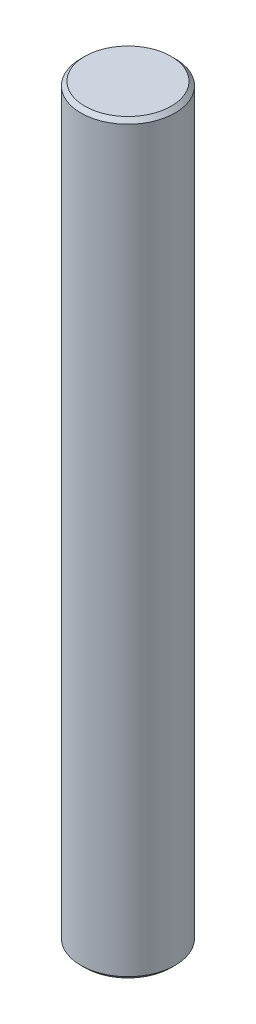
ISO-10303-21;
HEADER;
FILE_DESCRIPTION(('STEP AP214'),'2;1');
FILE_NAME('part.step','',(''),(''),'','','');
FILE_SCHEMA(('AUTOMOTIVE_DESIGN { 1 0 10303 214 1 1 1 1 }'));
ENDSEC;
DATA;
#1=APPLICATION_CONTEXT('core data for automotive mechanical design processes');
#2=APPLICATION_PROTOCOL_DEFINITION('international standard','automotive_design',2000,#1);
#3=PRODUCT_CONTEXT('',#1,'mechanical');
#4=PRODUCT('Part','Part','',(#3));
#5=PRODUCT_RELATED_PRODUCT_CATEGORY('part','',(#4));
#6=PRODUCT_DEFINITION_FORMATION('','',#4);
#7=PRODUCT_DEFINITION_CONTEXT('part definition',#1,'design');
#8=PRODUCT_DEFINITION('design','',#6,#7);
#9=PRODUCT_DEFINITION_SHAPE('','',#8);
#10=(LENGTH_UNIT() NAMED_UNIT(*) SI_UNIT(.MILLI.,.METRE.));
#11=(NAMED_UNIT(*) PLANE_ANGLE_UNIT() SI_UNIT($,.RADIAN.));
#12=(NAMED_UNIT(*) SI_UNIT($,.STERADIAN.) SOLID_ANGLE_UNIT());
#13=UNCERTAINTY_MEASURE_WITH_UNIT(LENGTH_MEASURE(1.E-05),#10,'distance_accuracy_value','');
#14=(GEOMETRIC_REPRESENTATION_CONTEXT(3) GLOBAL_UNCERTAINTY_ASSIGNED_CONTEXT((#13)) GLOBAL_UNIT_ASSIGNED_CONTEXT((#10,
#11,#12)) REPRESENTATION_CONTEXT('',''));
#15=CARTESIAN_POINT('',(0.,0.,0.));
#16=DIRECTION('',(0.,0.,1.));
#17=DIRECTION('',(1.,0.,0.));
#18=AXIS2_PLACEMENT_3D('',#15,#16,#17);
#19=CARTESIAN_POINT('',(0.,95.,0.));
#20=DIRECTION('',(0.,-1.,0.));
#21=DIRECTION('',(0.,0.,-1.));
#22=AXIS2_PLACEMENT_3D('',#19,#20,#21);
#23=CYLINDRICAL_SURFACE('',#22,6.);
#24=CARTESIAN_POINT('',(0.,0.499999999999973,0.));
#25=DIRECTION('',(0.,1.,0.));
#26=DIRECTION('',(0.,0.,1.));
#27=AXIS2_PLACEMENT_3D('',#24,#25,#26);
#28=CIRCLE('',#27,6.);
#29=CARTESIAN_POINT('',(0.,0.499999999999973,6.));
#30=VERTEX_POINT('',#29);
#31=EDGE_CURVE('E49',#30,#30,#28,.T.);
#32=ORIENTED_EDGE('',*,*,#31,.T.);
#33=EDGE_LOOP('',(#32));
#34=FACE_BOUND('',#33,.T.);
#35=CARTESIAN_POINT('',(0.,94.5,0.));
#36=DIRECTION('',(0.,1.,0.));
#37=DIRECTION('',(0.,0.,1.));
#38=AXIS2_PLACEMENT_3D('',#35,#36,#37);
#39=CIRCLE('',#38,6.);
#40=CARTESIAN_POINT('',(0.,94.5,6.));
#41=VERTEX_POINT('',#40);
#42=EDGE_CURVE('E53',#41,#41,#39,.F.);
#43=ORIENTED_EDGE('',*,*,#42,.T.);
#44=EDGE_LOOP('',(#43));
#45=FACE_BOUND('',#44,.T.);
#46=ADVANCED_FACE('F37',(#34,#45),#23,.T.);
#47=CARTESIAN_POINT('',(0.,95.,0.));
#48=DIRECTION('',(0.,1.,0.));
#49=DIRECTION('',(0.,0.,1.));
#50=AXIS2_PLACEMENT_3D('',#47,#48,#49);
#51=PLANE('',#50);
#52=CARTESIAN_POINT('',(0.,95.,0.));
#53=DIRECTION('',(0.,1.,0.));
#54=DIRECTION('',(0.,0.,1.));
#55=AXIS2_PLACEMENT_3D('',#52,#53,#54);
#56=CIRCLE('',#55,5.50000000000001);
#57=CARTESIAN_POINT('',(0.,95.,5.50000000000001));
#58=VERTEX_POINT('',#57);
#59=EDGE_CURVE('E10',#58,#58,#56,.T.);
#60=ORIENTED_EDGE('',*,*,#59,.T.);
#61=EDGE_LOOP('',(#60));
#62=FACE_BOUND('',#61,.T.);
#63=ADVANCED_FACE('F69',(#62),#51,.T.);
#64=CARTESIAN_POINT('',(0.,0.,0.));
#65=DIRECTION('',(0.,1.,0.));
#66=DIRECTION('',(0.,0.,1.));
#67=AXIS2_PLACEMENT_3D('',#64,#65,#66);
#68=PLANE('',#67);
#69=CARTESIAN_POINT('',(0.,0.,0.));
#70=DIRECTION('',(0.,1.,0.));
#71=DIRECTION('',(0.,0.,1.));
#72=AXIS2_PLACEMENT_3D('',#69,#70,#71);
#73=CIRCLE('',#72,5.50000000000002);
#74=CARTESIAN_POINT('',(0.,0.,5.50000000000002));
#75=VERTEX_POINT('',#74);
#76=EDGE_CURVE('E45',#75,#75,#73,.F.);
#77=ORIENTED_EDGE('',*,*,#76,.T.);
#78=EDGE_LOOP('',(#77));
#79=FACE_BOUND('',#78,.T.);
#80=ADVANCED_FACE('F66',(#79),#68,.F.);
#81=CARTESIAN_POINT('',(0.,0.499999999999973,0.));
#82=DIRECTION('',(0.,1.,0.));
#83=DIRECTION('',(0.,0.,1.));
#84=AXIS2_PLACEMENT_3D('',#81,#82,#83);
#85=CONICAL_SURFACE('',#84,6.,0.785398163397457);
#86=ORIENTED_EDGE('',*,*,#76,.F.);
#87=EDGE_LOOP('',(#86));
#88=FACE_BOUND('',#87,.T.);
#89=ORIENTED_EDGE('',*,*,#31,.F.);
#90=EDGE_LOOP('',(#89));
#91=FACE_BOUND('',#90,.T.);
#92=ADVANCED_FACE('F62',(#88,#91),#85,.T.);
#93=CARTESIAN_POINT('',(0.,95.,0.));
#94=DIRECTION('',(0.,-1.,0.));
#95=DIRECTION('',(0.,0.,-1.));
#96=AXIS2_PLACEMENT_3D('',#93,#94,#95);
#97=CONICAL_SURFACE('',#96,5.50000000000001,0.785398163397444);
#98=ORIENTED_EDGE('',*,*,#42,.F.);
#99=EDGE_LOOP('',(#98));
#100=FACE_BOUND('',#99,.T.);
#101=ORIENTED_EDGE('',*,*,#59,.F.);
#102=EDGE_LOOP('',(#101));
#103=FACE_BOUND('',#102,.T.);
#104=ADVANCED_FACE('F40',(#100,#103),#97,.T.);
#105=CLOSED_SHELL('',(#46,#63,#80,#92,#104));
#106=MANIFOLD_SOLID_BREP('B2',#105);
#107=ADVANCED_BREP_SHAPE_REPRESENTATION('',(#18,#106),#14);
#108=SHAPE_DEFINITION_REPRESENTATION(#9,#107);
ENDSEC;
END-ISO-10303-21;
